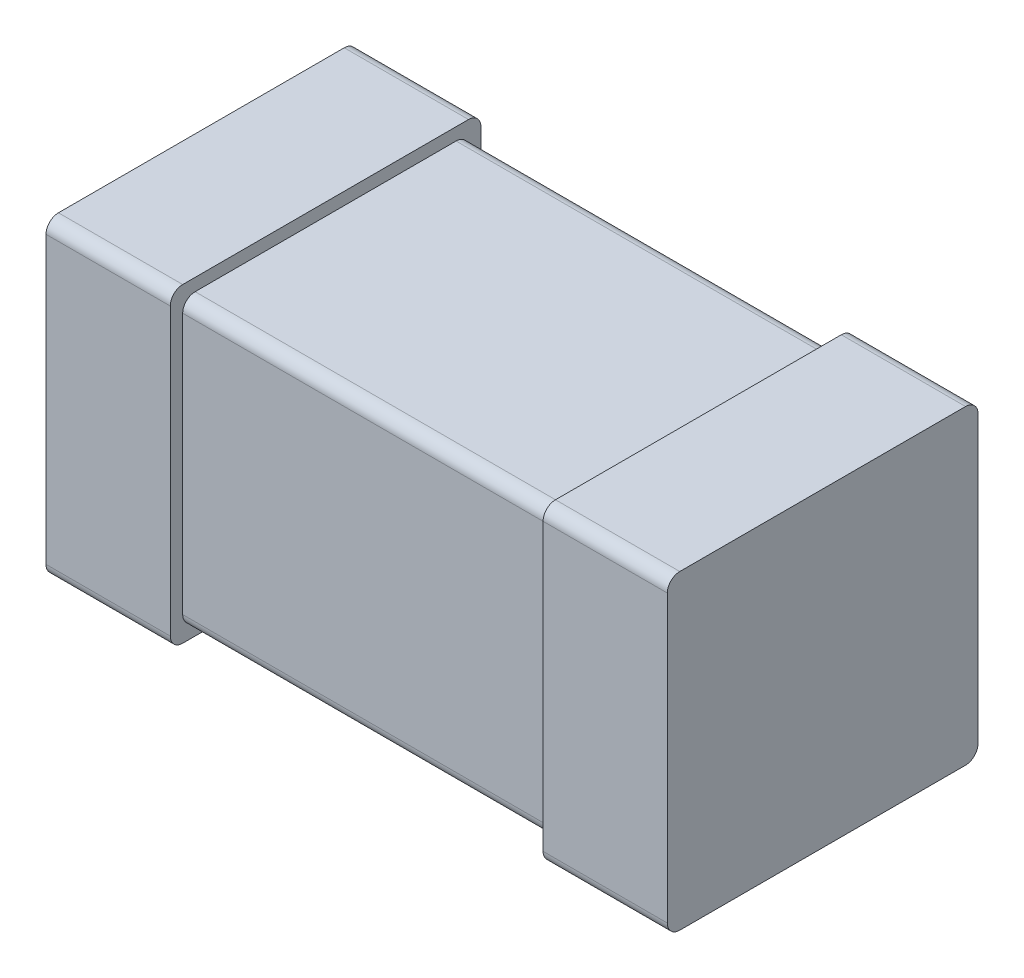
ISO-10303-21;
HEADER;
FILE_DESCRIPTION(('STEP AP214'),'2;1');
FILE_NAME('part.step','',(''),(''),'','','');
FILE_SCHEMA(('AUTOMOTIVE_DESIGN { 1 0 10303 214 1 1 1 1 }'));
ENDSEC;
DATA;
#1=APPLICATION_CONTEXT('core data for automotive mechanical design processes');
#2=APPLICATION_PROTOCOL_DEFINITION('international standard','automotive_design',2000,#1);
#3=PRODUCT_CONTEXT('',#1,'mechanical');
#4=PRODUCT('Part','Part','',(#3));
#5=PRODUCT_RELATED_PRODUCT_CATEGORY('part','',(#4));
#6=PRODUCT_DEFINITION_FORMATION('','',#4);
#7=PRODUCT_DEFINITION_CONTEXT('part definition',#1,'design');
#8=PRODUCT_DEFINITION('design','',#6,#7);
#9=PRODUCT_DEFINITION_SHAPE('','',#8);
#10=(LENGTH_UNIT() NAMED_UNIT(*) SI_UNIT(.MILLI.,.METRE.));
#11=(NAMED_UNIT(*) PLANE_ANGLE_UNIT() SI_UNIT($,.RADIAN.));
#12=(NAMED_UNIT(*) SI_UNIT($,.STERADIAN.) SOLID_ANGLE_UNIT());
#13=UNCERTAINTY_MEASURE_WITH_UNIT(LENGTH_MEASURE(1.E-05),#10,'distance_accuracy_value','');
#14=(GEOMETRIC_REPRESENTATION_CONTEXT(3) GLOBAL_UNCERTAINTY_ASSIGNED_CONTEXT((#13)) GLOBAL_UNIT_ASSIGNED_CONTEXT((#10,
#11,#12)) REPRESENTATION_CONTEXT('',''));
#15=CARTESIAN_POINT('',(0.,0.,0.));
#16=DIRECTION('',(0.,0.,1.));
#17=DIRECTION('',(1.,0.,0.));
#18=AXIS2_PLACEMENT_3D('',#15,#16,#17);
#19=CARTESIAN_POINT('',(0.5,-0.25,0.));
#20=DIRECTION('',(1.,0.,0.));
#21=DIRECTION('',(0.,1.,0.));
#22=AXIS2_PLACEMENT_3D('',#19,#20,#21);
#23=PLANE('',#22);
#24=DIRECTION('',(0.,0.,1.));
#25=VECTOR('',#24,1.);
#26=CARTESIAN_POINT('',(0.5,-0.25,0.));
#27=LINE('',#26,#25);
#28=CARTESIAN_POINT('',(0.5,-0.25,0.02));
#29=VERTEX_POINT('',#28);
#30=CARTESIAN_POINT('',(0.5,-0.25,0.48));
#31=VERTEX_POINT('',#30);
#32=EDGE_CURVE('E273',#29,#31,#27,.T.);
#33=ORIENTED_EDGE('',*,*,#32,.F.);
#34=CARTESIAN_POINT('',(0.5,-0.23,0.02));
#35=DIRECTION('',(1.,0.,0.));
#36=DIRECTION('',(0.,0.,1.));
#37=AXIS2_PLACEMENT_3D('',#34,#35,#36);
#38=CIRCLE('',#37,0.02);
#39=CARTESIAN_POINT('',(0.5,-0.23,0.));
#40=VERTEX_POINT('',#39);
#41=EDGE_CURVE('E291',#29,#40,#38,.T.);
#42=ORIENTED_EDGE('',*,*,#41,.T.);
#43=DIRECTION('',(0.,1.,0.));
#44=VECTOR('',#43,1.);
#45=CARTESIAN_POINT('',(0.5,-0.25,0.));
#46=LINE('',#45,#44);
#47=CARTESIAN_POINT('',(0.5,0.23,0.));
#48=VERTEX_POINT('',#47);
#49=EDGE_CURVE('E332',#40,#48,#46,.T.);
#50=ORIENTED_EDGE('',*,*,#49,.T.);
#51=CARTESIAN_POINT('',(0.5,0.23,0.02));
#52=DIRECTION('',(-1.,0.,0.));
#53=DIRECTION('',(0.,0.,1.));
#54=AXIS2_PLACEMENT_3D('',#51,#52,#53);
#55=CIRCLE('',#54,0.02);
#56=CARTESIAN_POINT('',(0.5,0.25,0.02));
#57=VERTEX_POINT('',#56);
#58=EDGE_CURVE('E480',#57,#48,#55,.T.);
#59=ORIENTED_EDGE('',*,*,#58,.F.);
#60=DIRECTION('',(0.,0.,1.));
#61=VECTOR('',#60,1.);
#62=CARTESIAN_POINT('',(0.5,0.25,0.));
#63=LINE('',#62,#61);
#64=CARTESIAN_POINT('',(0.5,0.25,0.48));
#65=VERTEX_POINT('',#64);
#66=EDGE_CURVE('E11',#57,#65,#63,.T.);
#67=ORIENTED_EDGE('',*,*,#66,.T.);
#68=CARTESIAN_POINT('',(0.5,0.23,0.48));
#69=DIRECTION('',(1.,0.,0.));
#70=DIRECTION('',(0.,0.,1.));
#71=AXIS2_PLACEMENT_3D('',#68,#69,#70);
#72=CIRCLE('',#71,0.02);
#73=CARTESIAN_POINT('',(0.5,0.23,0.5));
#74=VERTEX_POINT('',#73);
#75=EDGE_CURVE('E403',#65,#74,#72,.T.);
#76=ORIENTED_EDGE('',*,*,#75,.T.);
#77=DIRECTION('',(0.,1.,0.));
#78=VECTOR('',#77,1.);
#79=CARTESIAN_POINT('',(0.5,-0.25,0.5));
#80=LINE('',#79,#78);
#81=CARTESIAN_POINT('',(0.5,-0.23,0.5));
#82=VERTEX_POINT('',#81);
#83=EDGE_CURVE('E346',#82,#74,#80,.T.);
#84=ORIENTED_EDGE('',*,*,#83,.F.);
#85=CARTESIAN_POINT('',(0.5,-0.23,0.48));
#86=DIRECTION('',(-1.,0.,0.));
#87=DIRECTION('',(0.,0.,1.));
#88=AXIS2_PLACEMENT_3D('',#85,#86,#87);
#89=CIRCLE('',#88,0.02);
#90=EDGE_CURVE('E323',#31,#82,#89,.T.);
#91=ORIENTED_EDGE('',*,*,#90,.F.);
#92=EDGE_LOOP('',(#33,#42,#50,#59,#67,#76,#84,#91));
#93=FACE_BOUND('',#92,.T.);
#94=ADVANCED_FACE('F17',(#93),#23,.T.);
#95=CARTESIAN_POINT('',(0.3,0.25,0.));
#96=DIRECTION('',(0.,1.,0.));
#97=DIRECTION('',(1.,0.,0.));
#98=AXIS2_PLACEMENT_3D('',#95,#96,#97);
#99=PLANE('',#98);
#100=ORIENTED_EDGE('',*,*,#66,.F.);
#101=DIRECTION('',(1.,0.,0.));
#102=VECTOR('',#101,1.);
#103=CARTESIAN_POINT('',(0.3,0.25,0.02));
#104=LINE('',#103,#102);
#105=CARTESIAN_POINT('',(0.3,0.25,0.02));
#106=VERTEX_POINT('',#105);
#107=EDGE_CURVE('E254',#106,#57,#104,.T.);
#108=ORIENTED_EDGE('',*,*,#107,.F.);
#109=DIRECTION('',(0.,0.,1.));
#110=VECTOR('',#109,1.);
#111=CARTESIAN_POINT('',(0.3,0.25,0.));
#112=LINE('',#111,#110);
#113=CARTESIAN_POINT('',(0.3,0.25,0.48));
#114=VERTEX_POINT('',#113);
#115=EDGE_CURVE('E271',#106,#114,#112,.T.);
#116=ORIENTED_EDGE('',*,*,#115,.T.);
#117=DIRECTION('',(1.,0.,0.));
#118=VECTOR('',#117,1.);
#119=CARTESIAN_POINT('',(0.3,0.25,0.48));
#120=LINE('',#119,#118);
#121=EDGE_CURVE('E28',#114,#65,#120,.T.);
#122=ORIENTED_EDGE('',*,*,#121,.T.);
#123=EDGE_LOOP('',(#100,#108,#116,#122));
#124=FACE_BOUND('',#123,.T.);
#125=ADVANCED_FACE('F514',(#124),#99,.T.);
#126=CARTESIAN_POINT('',(0.3,0.23,0.48));
#127=DIRECTION('',(1.,0.,0.));
#128=DIRECTION('',(0.,1.,0.));
#129=AXIS2_PLACEMENT_3D('',#126,#127,#128);
#130=CYLINDRICAL_SURFACE('',#129,0.02);
#131=CARTESIAN_POINT('',(0.3,0.23,0.48));
#132=DIRECTION('',(1.,0.,0.));
#133=DIRECTION('',(0.,0.,1.));
#134=AXIS2_PLACEMENT_3D('',#131,#132,#133);
#135=CIRCLE('',#134,0.02);
#136=CARTESIAN_POINT('',(0.3,0.23,0.5));
#137=VERTEX_POINT('',#136);
#138=EDGE_CURVE('E267',#114,#137,#135,.T.);
#139=ORIENTED_EDGE('',*,*,#138,.T.);
#140=DIRECTION('',(1.,0.,0.));
#141=VECTOR('',#140,1.);
#142=CARTESIAN_POINT('',(0.3,0.23,0.5));
#143=LINE('',#142,#141);
#144=EDGE_CURVE('E347',#137,#74,#143,.T.);
#145=ORIENTED_EDGE('',*,*,#144,.T.);
#146=ORIENTED_EDGE('',*,*,#75,.F.);
#147=ORIENTED_EDGE('',*,*,#121,.F.);
#148=EDGE_LOOP('',(#139,#145,#146,#147));
#149=FACE_BOUND('',#148,.T.);
#150=ADVANCED_FACE('F512',(#149),#130,.T.);
#151=CARTESIAN_POINT('',(0.3,0.23,0.02));
#152=DIRECTION('',(1.,0.,0.));
#153=DIRECTION('',(0.,1.,0.));
#154=AXIS2_PLACEMENT_3D('',#151,#152,#153);
#155=CYLINDRICAL_SURFACE('',#154,0.02);
#156=ORIENTED_EDGE('',*,*,#107,.T.);
#157=ORIENTED_EDGE('',*,*,#58,.T.);
#158=DIRECTION('',(1.,0.,0.));
#159=VECTOR('',#158,1.);
#160=CARTESIAN_POINT('',(0.3,0.23,0.));
#161=LINE('',#160,#159);
#162=CARTESIAN_POINT('',(0.3,0.23,0.));
#163=VERTEX_POINT('',#162);
#164=EDGE_CURVE('E322',#163,#48,#161,.T.);
#165=ORIENTED_EDGE('',*,*,#164,.F.);
#166=CARTESIAN_POINT('',(0.3,0.23,0.02));
#167=DIRECTION('',(-1.,0.,0.));
#168=DIRECTION('',(0.,0.,1.));
#169=AXIS2_PLACEMENT_3D('',#166,#167,#168);
#170=CIRCLE('',#169,0.02);
#171=EDGE_CURVE('E465',#106,#163,#170,.T.);
#172=ORIENTED_EDGE('',*,*,#171,.F.);
#173=EDGE_LOOP('',(#156,#157,#165,#172));
#174=FACE_BOUND('',#173,.T.);
#175=ADVANCED_FACE('F521',(#174),#155,.T.);
#176=CARTESIAN_POINT('',(0.3,-0.25,0.5));
#177=DIRECTION('',(0.,0.,1.));
#178=DIRECTION('',(1.,0.,0.));
#179=AXIS2_PLACEMENT_3D('',#176,#177,#178);
#180=PLANE('',#179);
#181=DIRECTION('',(0.,1.,0.));
#182=VECTOR('',#181,1.);
#183=CARTESIAN_POINT('',(0.3,-0.25,0.5));
#184=LINE('',#183,#182);
#185=CARTESIAN_POINT('',(0.3,-0.23,0.5));
#186=VERTEX_POINT('',#185);
#187=EDGE_CURVE('E272',#186,#137,#184,.T.);
#188=ORIENTED_EDGE('',*,*,#187,.F.);
#189=DIRECTION('',(1.,0.,0.));
#190=VECTOR('',#189,1.);
#191=CARTESIAN_POINT('',(0.3,-0.23,0.5));
#192=LINE('',#191,#190);
#193=EDGE_CURVE('E319',#186,#82,#192,.T.);
#194=ORIENTED_EDGE('',*,*,#193,.T.);
#195=ORIENTED_EDGE('',*,*,#83,.T.);
#196=ORIENTED_EDGE('',*,*,#144,.F.);
#197=EDGE_LOOP('',(#188,#194,#195,#196));
#198=FACE_BOUND('',#197,.T.);
#199=ADVANCED_FACE('F509',(#198),#180,.T.);
#200=CARTESIAN_POINT('',(0.3,-0.25,0.));
#201=DIRECTION('',(0.,0.,1.));
#202=DIRECTION('',(1.,0.,0.));
#203=AXIS2_PLACEMENT_3D('',#200,#201,#202);
#204=PLANE('',#203);
#205=ORIENTED_EDGE('',*,*,#164,.T.);
#206=ORIENTED_EDGE('',*,*,#49,.F.);
#207=DIRECTION('',(1.,0.,0.));
#208=VECTOR('',#207,1.);
#209=CARTESIAN_POINT('',(0.3,-0.23,0.));
#210=LINE('',#209,#208);
#211=CARTESIAN_POINT('',(0.3,-0.23,0.));
#212=VERTEX_POINT('',#211);
#213=EDGE_CURVE('E277',#212,#40,#210,.T.);
#214=ORIENTED_EDGE('',*,*,#213,.F.);
#215=DIRECTION('',(0.,1.,0.));
#216=VECTOR('',#215,1.);
#217=CARTESIAN_POINT('',(0.3,-0.25,0.));
#218=LINE('',#217,#216);
#219=EDGE_CURVE('E452',#212,#163,#218,.T.);
#220=ORIENTED_EDGE('',*,*,#219,.T.);
#221=EDGE_LOOP('',(#205,#206,#214,#220));
#222=FACE_BOUND('',#221,.T.);
#223=ADVANCED_FACE('F524',(#222),#204,.F.);
#224=CARTESIAN_POINT('',(0.3,-0.23,0.48));
#225=DIRECTION('',(1.,0.,0.));
#226=DIRECTION('',(0.,-1.,0.));
#227=AXIS2_PLACEMENT_3D('',#224,#225,#226);
#228=CYLINDRICAL_SURFACE('',#227,0.02);
#229=DIRECTION('',(1.,0.,0.));
#230=VECTOR('',#229,1.);
#231=CARTESIAN_POINT('',(0.3,-0.25,0.48));
#232=LINE('',#231,#230);
#233=CARTESIAN_POINT('',(0.3,-0.25,0.48));
#234=VERTEX_POINT('',#233);
#235=EDGE_CURVE('E394',#234,#31,#232,.T.);
#236=ORIENTED_EDGE('',*,*,#235,.T.);
#237=ORIENTED_EDGE('',*,*,#90,.T.);
#238=ORIENTED_EDGE('',*,*,#193,.F.);
#239=CARTESIAN_POINT('',(0.3,-0.23,0.48));
#240=DIRECTION('',(-1.,0.,0.));
#241=DIRECTION('',(0.,0.,1.));
#242=AXIS2_PLACEMENT_3D('',#239,#240,#241);
#243=CIRCLE('',#242,0.02);
#244=EDGE_CURVE('E279',#234,#186,#243,.T.);
#245=ORIENTED_EDGE('',*,*,#244,.F.);
#246=EDGE_LOOP('',(#236,#237,#238,#245));
#247=FACE_BOUND('',#246,.T.);
#248=ADVANCED_FACE('F627',(#247),#228,.T.);
#249=CARTESIAN_POINT('',(0.3,-0.23,0.02));
#250=DIRECTION('',(1.,0.,0.));
#251=DIRECTION('',(0.,-1.,0.));
#252=AXIS2_PLACEMENT_3D('',#249,#250,#251);
#253=CYLINDRICAL_SURFACE('',#252,0.02);
#254=CARTESIAN_POINT('',(0.3,-0.23,0.02));
#255=DIRECTION('',(1.,0.,0.));
#256=DIRECTION('',(0.,0.,1.));
#257=AXIS2_PLACEMENT_3D('',#254,#255,#256);
#258=CIRCLE('',#257,0.02);
#259=CARTESIAN_POINT('',(0.3,-0.25,0.02));
#260=VERTEX_POINT('',#259);
#261=EDGE_CURVE('E448',#260,#212,#258,.T.);
#262=ORIENTED_EDGE('',*,*,#261,.T.);
#263=ORIENTED_EDGE('',*,*,#213,.T.);
#264=ORIENTED_EDGE('',*,*,#41,.F.);
#265=DIRECTION('',(1.,0.,0.));
#266=VECTOR('',#265,1.);
#267=CARTESIAN_POINT('',(0.3,-0.25,0.02));
#268=LINE('',#267,#266);
#269=EDGE_CURVE('E278',#260,#29,#268,.T.);
#270=ORIENTED_EDGE('',*,*,#269,.F.);
#271=EDGE_LOOP('',(#262,#263,#264,#270));
#272=FACE_BOUND('',#271,.T.);
#273=ADVANCED_FACE('F621',(#272),#253,.T.);
#274=CARTESIAN_POINT('',(0.3,-0.25,0.));
#275=DIRECTION('',(0.,1.,0.));
#276=DIRECTION('',(1.,0.,0.));
#277=AXIS2_PLACEMENT_3D('',#274,#275,#276);
#278=PLANE('',#277);
#279=ORIENTED_EDGE('',*,*,#235,.F.);
#280=DIRECTION('',(0.,0.,1.));
#281=VECTOR('',#280,1.);
#282=CARTESIAN_POINT('',(0.3,-0.25,0.));
#283=LINE('',#282,#281);
#284=EDGE_CURVE('E397',#260,#234,#283,.T.);
#285=ORIENTED_EDGE('',*,*,#284,.F.);
#286=ORIENTED_EDGE('',*,*,#269,.T.);
#287=ORIENTED_EDGE('',*,*,#32,.T.);
#288=EDGE_LOOP('',(#279,#285,#286,#287));
#289=FACE_BOUND('',#288,.T.);
#290=ADVANCED_FACE('F626',(#289),#278,.F.);
#291=CARTESIAN_POINT('',(0.3,-0.25,0.));
#292=DIRECTION('',(1.,0.,0.));
#293=DIRECTION('',(0.,1.,0.));
#294=AXIS2_PLACEMENT_3D('',#291,#292,#293);
#295=PLANE('',#294);
#296=DIRECTION('',(0.,1.,0.));
#297=VECTOR('',#296,1.);
#298=CARTESIAN_POINT('',(0.3,-0.23,0.02));
#299=LINE('',#298,#297);
#300=CARTESIAN_POINT('',(0.3,-0.21,0.02));
#301=VERTEX_POINT('',#300);
#302=CARTESIAN_POINT('',(0.3,0.21,0.02));
#303=VERTEX_POINT('',#302);
#304=EDGE_CURVE('E297',#301,#303,#299,.T.);
#305=ORIENTED_EDGE('',*,*,#304,.T.);
#306=CARTESIAN_POINT('',(0.3,0.21,0.04));
#307=DIRECTION('',(-1.,0.,0.));
#308=DIRECTION('',(0.,0.,1.));
#309=AXIS2_PLACEMENT_3D('',#306,#307,#308);
#310=CIRCLE('',#309,0.02);
#311=CARTESIAN_POINT('',(0.3,0.23,0.04));
#312=VERTEX_POINT('',#311);
#313=EDGE_CURVE('E296',#312,#303,#310,.T.);
#314=ORIENTED_EDGE('',*,*,#313,.F.);
#315=DIRECTION('',(0.,0.,1.));
#316=VECTOR('',#315,1.);
#317=CARTESIAN_POINT('',(0.3,0.23,0.02));
#318=LINE('',#317,#316);
#319=CARTESIAN_POINT('',(0.3,0.23,0.46));
#320=VERTEX_POINT('',#319);
#321=EDGE_CURVE('E385',#312,#320,#318,.T.);
#322=ORIENTED_EDGE('',*,*,#321,.T.);
#323=CARTESIAN_POINT('',(0.3,0.21,0.46));
#324=DIRECTION('',(1.,0.,0.));
#325=DIRECTION('',(0.,0.,1.));
#326=AXIS2_PLACEMENT_3D('',#323,#324,#325);
#327=CIRCLE('',#326,0.02);
#328=CARTESIAN_POINT('',(0.3,0.21,0.48));
#329=VERTEX_POINT('',#328);
#330=EDGE_CURVE('E301',#320,#329,#327,.T.);
#331=ORIENTED_EDGE('',*,*,#330,.T.);
#332=DIRECTION('',(0.,1.,0.));
#333=VECTOR('',#332,1.);
#334=CARTESIAN_POINT('',(0.3,-0.23,0.48));
#335=LINE('',#334,#333);
#336=CARTESIAN_POINT('',(0.3,-0.21,0.48));
#337=VERTEX_POINT('',#336);
#338=EDGE_CURVE('E438',#337,#329,#335,.T.);
#339=ORIENTED_EDGE('',*,*,#338,.F.);
#340=CARTESIAN_POINT('',(0.3,-0.21,0.46));
#341=DIRECTION('',(-1.,0.,0.));
#342=DIRECTION('',(0.,0.,1.));
#343=AXIS2_PLACEMENT_3D('',#340,#341,#342);
#344=CIRCLE('',#343,0.02);
#345=CARTESIAN_POINT('',(0.3,-0.23,0.46));
#346=VERTEX_POINT('',#345);
#347=EDGE_CURVE('E317',#346,#337,#344,.T.);
#348=ORIENTED_EDGE('',*,*,#347,.F.);
#349=DIRECTION('',(0.,0.,1.));
#350=VECTOR('',#349,1.);
#351=CARTESIAN_POINT('',(0.3,-0.23,0.02));
#352=LINE('',#351,#350);
#353=CARTESIAN_POINT('',(0.3,-0.23,0.04));
#354=VERTEX_POINT('',#353);
#355=EDGE_CURVE('E283',#354,#346,#352,.T.);
#356=ORIENTED_EDGE('',*,*,#355,.F.);
#357=CARTESIAN_POINT('',(0.3,-0.21,0.04));
#358=DIRECTION('',(1.,0.,0.));
#359=DIRECTION('',(0.,0.,1.));
#360=AXIS2_PLACEMENT_3D('',#357,#358,#359);
#361=CIRCLE('',#360,0.02);
#362=EDGE_CURVE('E393',#354,#301,#361,.T.);
#363=ORIENTED_EDGE('',*,*,#362,.T.);
#364=EDGE_LOOP('',(#305,#314,#322,#331,#339,#348,#356,#363));
#365=FACE_BOUND('',#364,.T.);
#366=ORIENTED_EDGE('',*,*,#244,.T.);
#367=ORIENTED_EDGE('',*,*,#187,.T.);
#368=ORIENTED_EDGE('',*,*,#138,.F.);
#369=ORIENTED_EDGE('',*,*,#115,.F.);
#370=ORIENTED_EDGE('',*,*,#171,.T.);
#371=ORIENTED_EDGE('',*,*,#219,.F.);
#372=ORIENTED_EDGE('',*,*,#261,.F.);
#373=ORIENTED_EDGE('',*,*,#284,.T.);
#374=EDGE_LOOP('',(#366,#367,#368,#369,#370,#371,#372,#373));
#375=FACE_BOUND('',#374,.T.);
#376=ADVANCED_FACE('F504',(#365,#375),#295,.F.);
#377=CARTESIAN_POINT('',(-0.3,-0.23,0.02));
#378=DIRECTION('',(0.,1.,0.));
#379=DIRECTION('',(1.,0.,0.));
#380=AXIS2_PLACEMENT_3D('',#377,#378,#379);
#381=PLANE('',#380);
#382=DIRECTION('',(1.,0.,0.));
#383=VECTOR('',#382,1.);
#384=CARTESIAN_POINT('',(-0.3,-0.23,0.46));
#385=LINE('',#384,#383);
#386=CARTESIAN_POINT('',(-0.3,-0.23,0.46));
#387=VERTEX_POINT('',#386);
#388=EDGE_CURVE('E21',#387,#346,#385,.T.);
#389=ORIENTED_EDGE('',*,*,#388,.F.);
#390=DIRECTION('',(0.,0.,1.));
#391=VECTOR('',#390,1.);
#392=CARTESIAN_POINT('',(-0.3,-0.23,0.02));
#393=LINE('',#392,#391);
#394=CARTESIAN_POINT('',(-0.3,-0.23,0.04));
#395=VERTEX_POINT('',#394);
#396=EDGE_CURVE('E310',#395,#387,#393,.T.);
#397=ORIENTED_EDGE('',*,*,#396,.F.);
#398=DIRECTION('',(1.,0.,0.));
#399=VECTOR('',#398,1.);
#400=CARTESIAN_POINT('',(-0.3,-0.23,0.04));
#401=LINE('',#400,#399);
#402=EDGE_CURVE('E444',#395,#354,#401,.T.);
#403=ORIENTED_EDGE('',*,*,#402,.T.);
#404=ORIENTED_EDGE('',*,*,#355,.T.);
#405=EDGE_LOOP('',(#389,#397,#403,#404));
#406=FACE_BOUND('',#405,.T.);
#407=ADVANCED_FACE('F635',(#406),#381,.F.);
#408=CARTESIAN_POINT('',(-0.3,-0.21,0.46));
#409=DIRECTION('',(1.,0.,0.));
#410=DIRECTION('',(0.,-1.,0.));
#411=AXIS2_PLACEMENT_3D('',#408,#409,#410);
#412=CYLINDRICAL_SURFACE('',#411,0.02);
#413=ORIENTED_EDGE('',*,*,#388,.T.);
#414=ORIENTED_EDGE('',*,*,#347,.T.);
#415=DIRECTION('',(1.,0.,0.));
#416=VECTOR('',#415,1.);
#417=CARTESIAN_POINT('',(-0.3,-0.21,0.48));
#418=LINE('',#417,#416);
#419=CARTESIAN_POINT('',(-0.3,-0.21,0.48));
#420=VERTEX_POINT('',#419);
#421=EDGE_CURVE('E146',#420,#337,#418,.T.);
#422=ORIENTED_EDGE('',*,*,#421,.F.);
#423=CARTESIAN_POINT('',(-0.3,-0.21,0.46));
#424=DIRECTION('',(-1.,0.,0.));
#425=DIRECTION('',(0.,0.,1.));
#426=AXIS2_PLACEMENT_3D('',#423,#424,#425);
#427=CIRCLE('',#426,0.02);
#428=EDGE_CURVE('E314',#387,#420,#427,.T.);
#429=ORIENTED_EDGE('',*,*,#428,.F.);
#430=EDGE_LOOP('',(#413,#414,#422,#429));
#431=FACE_BOUND('',#430,.T.);
#432=ADVANCED_FACE('F569',(#431),#412,.T.);
#433=CARTESIAN_POINT('',(-0.3,-0.23,0.48));
#434=DIRECTION('',(0.,0.,1.));
#435=DIRECTION('',(1.,0.,0.));
#436=AXIS2_PLACEMENT_3D('',#433,#434,#435);
#437=PLANE('',#436);
#438=DIRECTION('',(0.,1.,0.));
#439=VECTOR('',#438,1.);
#440=CARTESIAN_POINT('',(-0.3,-0.23,0.48));
#441=LINE('',#440,#439);
#442=CARTESIAN_POINT('',(-0.3,0.21,0.48));
#443=VERTEX_POINT('',#442);
#444=EDGE_CURVE('E378',#420,#443,#441,.T.);
#445=ORIENTED_EDGE('',*,*,#444,.F.);
#446=ORIENTED_EDGE('',*,*,#421,.T.);
#447=ORIENTED_EDGE('',*,*,#338,.T.);
#448=DIRECTION('',(1.,0.,0.));
#449=VECTOR('',#448,1.);
#450=CARTESIAN_POINT('',(-0.3,0.21,0.48));
#451=LINE('',#450,#449);
#452=EDGE_CURVE('E298',#443,#329,#451,.T.);
#453=ORIENTED_EDGE('',*,*,#452,.F.);
#454=EDGE_LOOP('',(#445,#446,#447,#453));
#455=FACE_BOUND('',#454,.T.);
#456=ADVANCED_FACE('F19',(#455),#437,.T.);
#457=CARTESIAN_POINT('',(-0.3,0.21,0.46));
#458=DIRECTION('',(1.,0.,0.));
#459=DIRECTION('',(0.,1.,0.));
#460=AXIS2_PLACEMENT_3D('',#457,#458,#459);
#461=CYLINDRICAL_SURFACE('',#460,0.02);
#462=CARTESIAN_POINT('',(-0.3,0.21,0.46));
#463=DIRECTION('',(1.,0.,0.));
#464=DIRECTION('',(0.,0.,1.));
#465=AXIS2_PLACEMENT_3D('',#462,#463,#464);
#466=CIRCLE('',#465,0.02);
#467=CARTESIAN_POINT('',(-0.3,0.23,0.46));
#468=VERTEX_POINT('',#467);
#469=EDGE_CURVE('E375',#468,#443,#466,.T.);
#470=ORIENTED_EDGE('',*,*,#469,.T.);
#471=ORIENTED_EDGE('',*,*,#452,.T.);
#472=ORIENTED_EDGE('',*,*,#330,.F.);
#473=DIRECTION('',(1.,0.,0.));
#474=VECTOR('',#473,1.);
#475=CARTESIAN_POINT('',(-0.3,0.23,0.46));
#476=LINE('',#475,#474);
#477=EDGE_CURVE('E302',#468,#320,#476,.T.);
#478=ORIENTED_EDGE('',*,*,#477,.F.);
#479=EDGE_LOOP('',(#470,#471,#472,#478));
#480=FACE_BOUND('',#479,.T.);
#481=ADVANCED_FACE('F562',(#480),#461,.T.);
#482=CARTESIAN_POINT('',(-0.3,0.23,0.02));
#483=DIRECTION('',(0.,1.,0.));
#484=DIRECTION('',(1.,0.,0.));
#485=AXIS2_PLACEMENT_3D('',#482,#483,#484);
#486=PLANE('',#485);
#487=ORIENTED_EDGE('',*,*,#321,.F.);
#488=DIRECTION('',(1.,0.,0.));
#489=VECTOR('',#488,1.);
#490=CARTESIAN_POINT('',(-0.3,0.23,0.04));
#491=LINE('',#490,#489);
#492=CARTESIAN_POINT('',(-0.3,0.23,0.04));
#493=VERTEX_POINT('',#492);
#494=EDGE_CURVE('E292',#493,#312,#491,.T.);
#495=ORIENTED_EDGE('',*,*,#494,.F.);
#496=DIRECTION('',(0.,0.,1.));
#497=VECTOR('',#496,1.);
#498=CARTESIAN_POINT('',(-0.3,0.23,0.02));
#499=LINE('',#498,#497);
#500=EDGE_CURVE('E266',#493,#468,#499,.T.);
#501=ORIENTED_EDGE('',*,*,#500,.T.);
#502=ORIENTED_EDGE('',*,*,#477,.T.);
#503=EDGE_LOOP('',(#487,#495,#501,#502));
#504=FACE_BOUND('',#503,.T.);
#505=ADVANCED_FACE('F550',(#504),#486,.T.);
#506=CARTESIAN_POINT('',(-0.3,0.21,0.04));
#507=DIRECTION('',(1.,0.,0.));
#508=DIRECTION('',(0.,1.,0.));
#509=AXIS2_PLACEMENT_3D('',#506,#507,#508);
#510=CYLINDRICAL_SURFACE('',#509,0.02);
#511=ORIENTED_EDGE('',*,*,#494,.T.);
#512=ORIENTED_EDGE('',*,*,#313,.T.);
#513=DIRECTION('',(1.,0.,0.));
#514=VECTOR('',#513,1.);
#515=CARTESIAN_POINT('',(-0.3,0.21,0.02));
#516=LINE('',#515,#514);
#517=CARTESIAN_POINT('',(-0.3,0.21,0.02));
#518=VERTEX_POINT('',#517);
#519=EDGE_CURVE('E437',#518,#303,#516,.T.);
#520=ORIENTED_EDGE('',*,*,#519,.F.);
#521=CARTESIAN_POINT('',(-0.3,0.21,0.04));
#522=DIRECTION('',(-1.,0.,0.));
#523=DIRECTION('',(0.,0.,1.));
#524=AXIS2_PLACEMENT_3D('',#521,#522,#523);
#525=CIRCLE('',#524,0.02);
#526=EDGE_CURVE('E261',#493,#518,#525,.T.);
#527=ORIENTED_EDGE('',*,*,#526,.F.);
#528=EDGE_LOOP('',(#511,#512,#520,#527));
#529=FACE_BOUND('',#528,.T.);
#530=ADVANCED_FACE('F554',(#529),#510,.T.);
#531=CARTESIAN_POINT('',(-0.3,-0.23,0.02));
#532=DIRECTION('',(0.,0.,1.));
#533=DIRECTION('',(1.,0.,0.));
#534=AXIS2_PLACEMENT_3D('',#531,#532,#533);
#535=PLANE('',#534);
#536=ORIENTED_EDGE('',*,*,#519,.T.);
#537=ORIENTED_EDGE('',*,*,#304,.F.);
#538=DIRECTION('',(1.,0.,0.));
#539=VECTOR('',#538,1.);
#540=CARTESIAN_POINT('',(-0.3,-0.21,0.02));
#541=LINE('',#540,#539);
#542=CARTESIAN_POINT('',(-0.3,-0.21,0.02));
#543=VERTEX_POINT('',#542);
#544=EDGE_CURVE('E389',#543,#301,#541,.T.);
#545=ORIENTED_EDGE('',*,*,#544,.F.);
#546=DIRECTION('',(0.,1.,0.));
#547=VECTOR('',#546,1.);
#548=CARTESIAN_POINT('',(-0.3,-0.23,0.02));
#549=LINE('',#548,#547);
#550=EDGE_CURVE('E265',#543,#518,#549,.T.);
#551=ORIENTED_EDGE('',*,*,#550,.T.);
#552=EDGE_LOOP('',(#536,#537,#545,#551));
#553=FACE_BOUND('',#552,.T.);
#554=ADVANCED_FACE('F679',(#553),#535,.F.);
#555=CARTESIAN_POINT('',(-0.3,-0.21,0.04));
#556=DIRECTION('',(1.,0.,0.));
#557=DIRECTION('',(0.,-1.,0.));
#558=AXIS2_PLACEMENT_3D('',#555,#556,#557);
#559=CYLINDRICAL_SURFACE('',#558,0.02);
#560=CARTESIAN_POINT('',(-0.3,-0.21,0.04));
#561=DIRECTION('',(1.,0.,0.));
#562=DIRECTION('',(0.,0.,1.));
#563=AXIS2_PLACEMENT_3D('',#560,#561,#562);
#564=CIRCLE('',#563,0.02);
#565=EDGE_CURVE('E287',#395,#543,#564,.T.);
#566=ORIENTED_EDGE('',*,*,#565,.T.);
#567=ORIENTED_EDGE('',*,*,#544,.T.);
#568=ORIENTED_EDGE('',*,*,#362,.F.);
#569=ORIENTED_EDGE('',*,*,#402,.F.);
#570=EDGE_LOOP('',(#566,#567,#568,#569));
#571=FACE_BOUND('',#570,.T.);
#572=ADVANCED_FACE('F674',(#571),#559,.T.);
#573=CARTESIAN_POINT('',(-0.3,-0.25,0.));
#574=DIRECTION('',(1.,0.,0.));
#575=DIRECTION('',(0.,1.,0.));
#576=AXIS2_PLACEMENT_3D('',#573,#574,#575);
#577=PLANE('',#576);
#578=ORIENTED_EDGE('',*,*,#565,.F.);
#579=ORIENTED_EDGE('',*,*,#396,.T.);
#580=ORIENTED_EDGE('',*,*,#428,.T.);
#581=ORIENTED_EDGE('',*,*,#444,.T.);
#582=ORIENTED_EDGE('',*,*,#469,.F.);
#583=ORIENTED_EDGE('',*,*,#500,.F.);
#584=ORIENTED_EDGE('',*,*,#526,.T.);
#585=ORIENTED_EDGE('',*,*,#550,.F.);
#586=EDGE_LOOP('',(#578,#579,#580,#581,#582,#583,#584,#585));
#587=FACE_BOUND('',#586,.T.);
#588=DIRECTION('',(0.,0.,1.));
#589=VECTOR('',#588,1.);
#590=CARTESIAN_POINT('',(-0.3,-0.25,0.));
#591=LINE('',#590,#589);
#592=CARTESIAN_POINT('',(-0.3,-0.25,0.02));
#593=VERTEX_POINT('',#592);
#594=CARTESIAN_POINT('',(-0.3,-0.25,0.48));
#595=VERTEX_POINT('',#594);
#596=EDGE_CURVE('E224',#593,#595,#591,.T.);
#597=ORIENTED_EDGE('',*,*,#596,.F.);
#598=CARTESIAN_POINT('',(-0.3,-0.23,0.02));
#599=DIRECTION('',(1.,0.,0.));
#600=DIRECTION('',(0.,0.,1.));
#601=AXIS2_PLACEMENT_3D('',#598,#599,#600);
#602=CIRCLE('',#601,0.02);
#603=CARTESIAN_POINT('',(-0.3,-0.23,0.));
#604=VERTEX_POINT('',#603);
#605=EDGE_CURVE('E384',#593,#604,#602,.T.);
#606=ORIENTED_EDGE('',*,*,#605,.T.);
#607=DIRECTION('',(0.,1.,0.));
#608=VECTOR('',#607,1.);
#609=CARTESIAN_POINT('',(-0.3,-0.25,0.));
#610=LINE('',#609,#608);
#611=CARTESIAN_POINT('',(-0.3,0.23,0.));
#612=VERTEX_POINT('',#611);
#613=EDGE_CURVE('E365',#604,#612,#610,.T.);
#614=ORIENTED_EDGE('',*,*,#613,.T.);
#615=CARTESIAN_POINT('',(-0.3,0.23,0.02));
#616=DIRECTION('',(-1.,0.,0.));
#617=DIRECTION('',(0.,0.,1.));
#618=AXIS2_PLACEMENT_3D('',#615,#616,#617);
#619=CIRCLE('',#618,0.02);
#620=CARTESIAN_POINT('',(-0.3,0.25,0.02));
#621=VERTEX_POINT('',#620);
#622=EDGE_CURVE('E259',#621,#612,#619,.T.);
#623=ORIENTED_EDGE('',*,*,#622,.F.);
#624=DIRECTION('',(0.,0.,1.));
#625=VECTOR('',#624,1.);
#626=CARTESIAN_POINT('',(-0.3,0.25,0.));
#627=LINE('',#626,#625);
#628=CARTESIAN_POINT('',(-0.3,0.25,0.48));
#629=VERTEX_POINT('',#628);
#630=EDGE_CURVE('E284',#621,#629,#627,.T.);
#631=ORIENTED_EDGE('',*,*,#630,.T.);
#632=CARTESIAN_POINT('',(-0.3,0.23,0.48));
#633=DIRECTION('',(1.,0.,0.));
#634=DIRECTION('',(0.,0.,1.));
#635=AXIS2_PLACEMENT_3D('',#632,#633,#634);
#636=CIRCLE('',#635,0.02);
#637=CARTESIAN_POINT('',(-0.3,0.23,0.5));
#638=VERTEX_POINT('',#637);
#639=EDGE_CURVE('E366',#629,#638,#636,.T.);
#640=ORIENTED_EDGE('',*,*,#639,.T.);
#641=DIRECTION('',(0.,1.,0.));
#642=VECTOR('',#641,1.);
#643=CARTESIAN_POINT('',(-0.3,-0.25,0.5));
#644=LINE('',#643,#642);
#645=CARTESIAN_POINT('',(-0.3,-0.23,0.5));
#646=VERTEX_POINT('',#645);
#647=EDGE_CURVE('E362',#646,#638,#644,.T.);
#648=ORIENTED_EDGE('',*,*,#647,.F.);
#649=CARTESIAN_POINT('',(-0.3,-0.23,0.48));
#650=DIRECTION('',(-1.,0.,0.));
#651=DIRECTION('',(0.,0.,1.));
#652=AXIS2_PLACEMENT_3D('',#649,#650,#651);
#653=CIRCLE('',#652,0.02);
#654=EDGE_CURVE('E407',#595,#646,#653,.T.);
#655=ORIENTED_EDGE('',*,*,#654,.F.);
#656=EDGE_LOOP('',(#597,#606,#614,#623,#631,#640,#648,#655));
#657=FACE_BOUND('',#656,.T.);
#658=ADVANCED_FACE('F419',(#587,#657),#577,.T.);
#659=CARTESIAN_POINT('',(-0.5,0.25,0.));
#660=DIRECTION('',(0.,1.,0.));
#661=DIRECTION('',(1.,0.,0.));
#662=AXIS2_PLACEMENT_3D('',#659,#660,#661);
#663=PLANE('',#662);
#664=ORIENTED_EDGE('',*,*,#630,.F.);
#665=DIRECTION('',(1.,0.,0.));
#666=VECTOR('',#665,1.);
#667=CARTESIAN_POINT('',(-0.5,0.25,0.02));
#668=LINE('',#667,#666);
#669=CARTESIAN_POINT('',(-0.5,0.25,0.02));
#670=VERTEX_POINT('',#669);
#671=EDGE_CURVE('E181',#670,#621,#668,.T.);
#672=ORIENTED_EDGE('',*,*,#671,.F.);
#673=DIRECTION('',(0.,0.,1.));
#674=VECTOR('',#673,1.);
#675=CARTESIAN_POINT('',(-0.5,0.25,0.));
#676=LINE('',#675,#674);
#677=CARTESIAN_POINT('',(-0.5,0.25,0.48));
#678=VERTEX_POINT('',#677);
#679=EDGE_CURVE('E309',#670,#678,#676,.T.);
#680=ORIENTED_EDGE('',*,*,#679,.T.);
#681=DIRECTION('',(1.,0.,0.));
#682=VECTOR('',#681,1.);
#683=CARTESIAN_POINT('',(-0.5,0.25,0.48));
#684=LINE('',#683,#682);
#685=EDGE_CURVE('E193',#678,#629,#684,.T.);
#686=ORIENTED_EDGE('',*,*,#685,.T.);
#687=EDGE_LOOP('',(#664,#672,#680,#686));
#688=FACE_BOUND('',#687,.T.);
#689=ADVANCED_FACE('F411',(#688),#663,.T.);
#690=CARTESIAN_POINT('',(-0.5,0.23,0.48));
#691=DIRECTION('',(1.,0.,0.));
#692=DIRECTION('',(0.,1.,0.));
#693=AXIS2_PLACEMENT_3D('',#690,#691,#692);
#694=CYLINDRICAL_SURFACE('',#693,0.02);
#695=CARTESIAN_POINT('',(-0.5,0.23,0.48));
#696=DIRECTION('',(1.,0.,0.));
#697=DIRECTION('',(0.,0.,1.));
#698=AXIS2_PLACEMENT_3D('',#695,#696,#697);
#699=CIRCLE('',#698,0.02);
#700=CARTESIAN_POINT('',(-0.5,0.23,0.5));
#701=VERTEX_POINT('',#700);
#702=EDGE_CURVE('E251',#678,#701,#699,.T.);
#703=ORIENTED_EDGE('',*,*,#702,.T.);
#704=DIRECTION('',(1.,0.,0.));
#705=VECTOR('',#704,1.);
#706=CARTESIAN_POINT('',(-0.5,0.23,0.5));
#707=LINE('',#706,#705);
#708=EDGE_CURVE('E260',#701,#638,#707,.T.);
#709=ORIENTED_EDGE('',*,*,#708,.T.);
#710=ORIENTED_EDGE('',*,*,#639,.F.);
#711=ORIENTED_EDGE('',*,*,#685,.F.);
#712=EDGE_LOOP('',(#703,#709,#710,#711));
#713=FACE_BOUND('',#712,.T.);
#714=ADVANCED_FACE('F416',(#713),#694,.T.);
#715=CARTESIAN_POINT('',(-0.5,0.23,0.02));
#716=DIRECTION('',(1.,0.,0.));
#717=DIRECTION('',(0.,1.,0.));
#718=AXIS2_PLACEMENT_3D('',#715,#716,#717);
#719=CYLINDRICAL_SURFACE('',#718,0.02);
#720=ORIENTED_EDGE('',*,*,#671,.T.);
#721=ORIENTED_EDGE('',*,*,#622,.T.);
#722=DIRECTION('',(1.,0.,0.));
#723=VECTOR('',#722,1.);
#724=CARTESIAN_POINT('',(-0.5,0.23,0.));
#725=LINE('',#724,#723);
#726=CARTESIAN_POINT('',(-0.5,0.23,0.));
#727=VERTEX_POINT('',#726);
#728=EDGE_CURVE('E372',#727,#612,#725,.T.);
#729=ORIENTED_EDGE('',*,*,#728,.F.);
#730=CARTESIAN_POINT('',(-0.5,0.23,0.02));
#731=DIRECTION('',(-1.,0.,0.));
#732=DIRECTION('',(0.,0.,1.));
#733=AXIS2_PLACEMENT_3D('',#730,#731,#732);
#734=CIRCLE('',#733,0.02);
#735=EDGE_CURVE('E304',#670,#727,#734,.T.);
#736=ORIENTED_EDGE('',*,*,#735,.F.);
#737=EDGE_LOOP('',(#720,#721,#729,#736));
#738=FACE_BOUND('',#737,.T.);
#739=ADVANCED_FACE('F427',(#738),#719,.T.);
#740=CARTESIAN_POINT('',(-0.5,-0.25,0.5));
#741=DIRECTION('',(0.,0.,1.));
#742=DIRECTION('',(1.,0.,0.));
#743=AXIS2_PLACEMENT_3D('',#740,#741,#742);
#744=PLANE('',#743);
#745=DIRECTION('',(0.,1.,0.));
#746=VECTOR('',#745,1.);
#747=CARTESIAN_POINT('',(-0.5,-0.25,0.5));
#748=LINE('',#747,#746);
#749=CARTESIAN_POINT('',(-0.5,-0.23,0.5));
#750=VERTEX_POINT('',#749);
#751=EDGE_CURVE('E246',#750,#701,#748,.T.);
#752=ORIENTED_EDGE('',*,*,#751,.F.);
#753=DIRECTION('',(1.,0.,0.));
#754=VECTOR('',#753,1.);
#755=CARTESIAN_POINT('',(-0.5,-0.23,0.5));
#756=LINE('',#755,#754);
#757=EDGE_CURVE('E243',#750,#646,#756,.T.);
#758=ORIENTED_EDGE('',*,*,#757,.T.);
#759=ORIENTED_EDGE('',*,*,#647,.T.);
#760=ORIENTED_EDGE('',*,*,#708,.F.);
#761=EDGE_LOOP('',(#752,#758,#759,#760));
#762=FACE_BOUND('',#761,.T.);
#763=ADVANCED_FACE('F606',(#762),#744,.T.);
#764=CARTESIAN_POINT('',(-0.5,-0.25,0.));
#765=DIRECTION('',(0.,0.,1.));
#766=DIRECTION('',(1.,0.,0.));
#767=AXIS2_PLACEMENT_3D('',#764,#765,#766);
#768=PLANE('',#767);
#769=ORIENTED_EDGE('',*,*,#728,.T.);
#770=ORIENTED_EDGE('',*,*,#613,.F.);
#771=DIRECTION('',(1.,0.,0.));
#772=VECTOR('',#771,1.);
#773=CARTESIAN_POINT('',(-0.5,-0.23,0.));
#774=LINE('',#773,#772);
#775=CARTESIAN_POINT('',(-0.5,-0.23,0.));
#776=VERTEX_POINT('',#775);
#777=EDGE_CURVE('E380',#776,#604,#774,.T.);
#778=ORIENTED_EDGE('',*,*,#777,.F.);
#779=DIRECTION('',(0.,1.,0.));
#780=VECTOR('',#779,1.);
#781=CARTESIAN_POINT('',(-0.5,-0.25,0.));
#782=LINE('',#781,#780);
#783=EDGE_CURVE('E308',#776,#727,#782,.T.);
#784=ORIENTED_EDGE('',*,*,#783,.T.);
#785=EDGE_LOOP('',(#769,#770,#778,#784));
#786=FACE_BOUND('',#785,.T.);
#787=ADVANCED_FACE('F536',(#786),#768,.F.);
#788=CARTESIAN_POINT('',(-0.5,-0.23,0.48));
#789=DIRECTION('',(1.,0.,0.));
#790=DIRECTION('',(0.,-1.,0.));
#791=AXIS2_PLACEMENT_3D('',#788,#789,#790);
#792=CYLINDRICAL_SURFACE('',#791,0.02);
#793=DIRECTION('',(1.,0.,0.));
#794=VECTOR('',#793,1.);
#795=CARTESIAN_POINT('',(-0.5,-0.25,0.48));
#796=LINE('',#795,#794);
#797=CARTESIAN_POINT('',(-0.5,-0.25,0.48));
#798=VERTEX_POINT('',#797);
#799=EDGE_CURVE('E217',#798,#595,#796,.T.);
#800=ORIENTED_EDGE('',*,*,#799,.T.);
#801=ORIENTED_EDGE('',*,*,#654,.T.);
#802=ORIENTED_EDGE('',*,*,#757,.F.);
#803=CARTESIAN_POINT('',(-0.5,-0.23,0.48));
#804=DIRECTION('',(-1.,0.,0.));
#805=DIRECTION('',(0.,0.,1.));
#806=AXIS2_PLACEMENT_3D('',#803,#804,#805);
#807=CIRCLE('',#806,0.02);
#808=EDGE_CURVE('E235',#798,#750,#807,.T.);
#809=ORIENTED_EDGE('',*,*,#808,.F.);
#810=EDGE_LOOP('',(#800,#801,#802,#809));
#811=FACE_BOUND('',#810,.T.);
#812=ADVANCED_FACE('F241',(#811),#792,.T.);
#813=CARTESIAN_POINT('',(-0.5,-0.23,0.02));
#814=DIRECTION('',(1.,0.,0.));
#815=DIRECTION('',(0.,-1.,0.));
#816=AXIS2_PLACEMENT_3D('',#813,#814,#815);
#817=CYLINDRICAL_SURFACE('',#816,0.02);
#818=CARTESIAN_POINT('',(-0.5,-0.23,0.02));
#819=DIRECTION('',(1.,0.,0.));
#820=DIRECTION('',(0.,0.,1.));
#821=AXIS2_PLACEMENT_3D('',#818,#819,#820);
#822=CIRCLE('',#821,0.02);
#823=CARTESIAN_POINT('',(-0.5,-0.25,0.02));
#824=VERTEX_POINT('',#823);
#825=EDGE_CURVE('E238',#824,#776,#822,.T.);
#826=ORIENTED_EDGE('',*,*,#825,.T.);
#827=ORIENTED_EDGE('',*,*,#777,.T.);
#828=ORIENTED_EDGE('',*,*,#605,.F.);
#829=DIRECTION('',(1.,0.,0.));
#830=VECTOR('',#829,1.);
#831=CARTESIAN_POINT('',(-0.5,-0.25,0.02));
#832=LINE('',#831,#830);
#833=EDGE_CURVE('E229',#824,#593,#832,.T.);
#834=ORIENTED_EDGE('',*,*,#833,.F.);
#835=EDGE_LOOP('',(#826,#827,#828,#834));
#836=FACE_BOUND('',#835,.T.);
#837=ADVANCED_FACE('F576',(#836),#817,.T.);
#838=CARTESIAN_POINT('',(-0.5,-0.25,0.));
#839=DIRECTION('',(0.,1.,0.));
#840=DIRECTION('',(1.,0.,0.));
#841=AXIS2_PLACEMENT_3D('',#838,#839,#840);
#842=PLANE('',#841);
#843=ORIENTED_EDGE('',*,*,#799,.F.);
#844=DIRECTION('',(0.,0.,1.));
#845=VECTOR('',#844,1.);
#846=CARTESIAN_POINT('',(-0.5,-0.25,0.));
#847=LINE('',#846,#845);
#848=EDGE_CURVE('E221',#824,#798,#847,.T.);
#849=ORIENTED_EDGE('',*,*,#848,.F.);
#850=ORIENTED_EDGE('',*,*,#833,.T.);
#851=ORIENTED_EDGE('',*,*,#596,.T.);
#852=EDGE_LOOP('',(#843,#849,#850,#851));
#853=FACE_BOUND('',#852,.T.);
#854=ADVANCED_FACE('F219',(#853),#842,.F.);
#855=CARTESIAN_POINT('',(-0.5,-0.25,0.));
#856=DIRECTION('',(1.,0.,0.));
#857=DIRECTION('',(0.,1.,0.));
#858=AXIS2_PLACEMENT_3D('',#855,#856,#857);
#859=PLANE('',#858);
#860=ORIENTED_EDGE('',*,*,#808,.T.);
#861=ORIENTED_EDGE('',*,*,#751,.T.);
#862=ORIENTED_EDGE('',*,*,#702,.F.);
#863=ORIENTED_EDGE('',*,*,#679,.F.);
#864=ORIENTED_EDGE('',*,*,#735,.T.);
#865=ORIENTED_EDGE('',*,*,#783,.F.);
#866=ORIENTED_EDGE('',*,*,#825,.F.);
#867=ORIENTED_EDGE('',*,*,#848,.T.);
#868=EDGE_LOOP('',(#860,#861,#862,#863,#864,#865,#866,#867));
#869=FACE_BOUND('',#868,.T.);
#870=ADVANCED_FACE('F233',(#869),#859,.F.);
#871=CLOSED_SHELL('',(#94,#125,#150,#175,#199,#223,#248,#273,#290,#376,#407,#432,#456,#481,#505,
#530,#554,#572,#658,#689,#714,#739,#763,#787,#812,#837,#854,#870));
#872=MANIFOLD_SOLID_BREP('B1',#871);
#873=ADVANCED_BREP_SHAPE_REPRESENTATION('',(#18,#872),#14);
#874=SHAPE_DEFINITION_REPRESENTATION(#9,#873);
ENDSEC;
END-ISO-10303-21;
